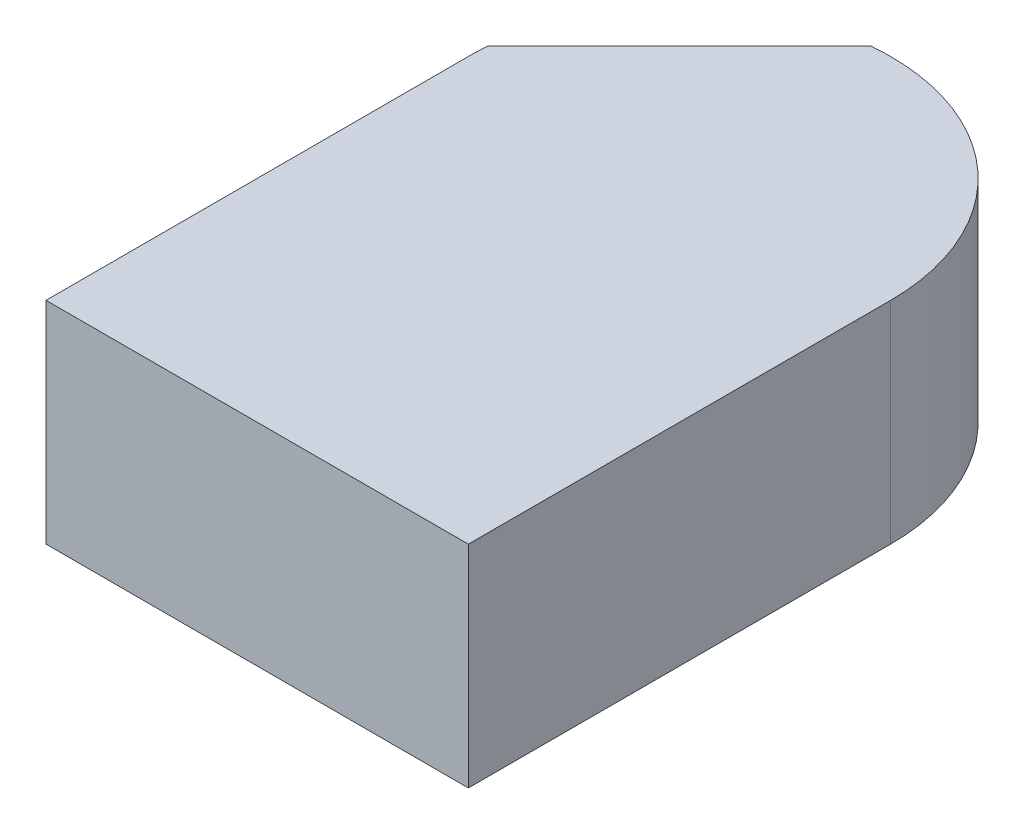
ISO-10303-21;
HEADER;
FILE_DESCRIPTION(('STEP AP214'),'2;1');
FILE_NAME('part.step','',(''),(''),'','','');
FILE_SCHEMA(('AUTOMOTIVE_DESIGN { 1 0 10303 214 1 1 1 1 }'));
ENDSEC;
DATA;
#1=APPLICATION_CONTEXT('core data for automotive mechanical design processes');
#2=APPLICATION_PROTOCOL_DEFINITION('international standard','automotive_design',2000,#1);
#3=PRODUCT_CONTEXT('',#1,'mechanical');
#4=PRODUCT('Part','Part','',(#3));
#5=PRODUCT_RELATED_PRODUCT_CATEGORY('part','',(#4));
#6=PRODUCT_DEFINITION_FORMATION('','',#4);
#7=PRODUCT_DEFINITION_CONTEXT('part definition',#1,'design');
#8=PRODUCT_DEFINITION('design','',#6,#7);
#9=PRODUCT_DEFINITION_SHAPE('','',#8);
#10=(LENGTH_UNIT() NAMED_UNIT(*) SI_UNIT(.MILLI.,.METRE.));
#11=(NAMED_UNIT(*) PLANE_ANGLE_UNIT() SI_UNIT($,.RADIAN.));
#12=(NAMED_UNIT(*) SI_UNIT($,.STERADIAN.) SOLID_ANGLE_UNIT());
#13=UNCERTAINTY_MEASURE_WITH_UNIT(LENGTH_MEASURE(1.E-05),#10,'distance_accuracy_value','');
#14=(GEOMETRIC_REPRESENTATION_CONTEXT(3) GLOBAL_UNCERTAINTY_ASSIGNED_CONTEXT((#13)) GLOBAL_UNIT_ASSIGNED_CONTEXT((#10,
#11,#12)) REPRESENTATION_CONTEXT('',''));
#15=CARTESIAN_POINT('',(0.,0.,0.));
#16=DIRECTION('',(0.,0.,1.));
#17=DIRECTION('',(1.,0.,0.));
#18=AXIS2_PLACEMENT_3D('',#15,#16,#17);
#19=CARTESIAN_POINT('',(0.,0.,0.));
#20=DIRECTION('',(0.,-1.,0.));
#21=DIRECTION('',(1.,0.,0.));
#22=AXIS2_PLACEMENT_3D('',#19,#20,#21);
#23=PLANE('',#22);
#24=CARTESIAN_POINT('',(-0.8,0.,2.05));
#25=DIRECTION('',(0.,-1.,0.));
#26=DIRECTION('',(-0.0898292575823554,0.,-0.995957180044505));
#27=AXIS2_PLACEMENT_3D('',#24,#25,#26);
#28=CIRCLE('',#27,0.1);
#29=CARTESIAN_POINT('',(-0.808982925758,0.,1.950404281996));
#30=VERTEX_POINT('',#29);
#31=CARTESIAN_POINT('',(-0.7,0.,2.05));
#32=VERTEX_POINT('',#31);
#33=EDGE_CURVE('E11',#30,#32,#28,.T.);
#34=ORIENTED_EDGE('',*,*,#33,.T.);
#35=DIRECTION('',(0.,0.,1.));
#36=VECTOR('',#35,1.);
#37=CARTESIAN_POINT('',(-0.7,0.,2.05));
#38=LINE('',#37,#36);
#39=CARTESIAN_POINT('',(-0.7,0.,2.25));
#40=VERTEX_POINT('',#39);
#41=EDGE_CURVE('E25',#32,#40,#38,.T.);
#42=ORIENTED_EDGE('',*,*,#41,.T.);
#43=DIRECTION('',(-1.,0.,0.));
#44=VECTOR('',#43,1.);
#45=CARTESIAN_POINT('',(-0.7,0.,2.25));
#46=LINE('',#45,#44);
#47=CARTESIAN_POINT('',(-0.9,0.,2.25));
#48=VERTEX_POINT('',#47);
#49=EDGE_CURVE('E143',#40,#48,#46,.T.);
#50=ORIENTED_EDGE('',*,*,#49,.T.);
#51=DIRECTION('',(0.,0.,-1.));
#52=VECTOR('',#51,1.);
#53=CARTESIAN_POINT('',(-0.9,0.,2.25));
#54=LINE('',#53,#52);
#55=CARTESIAN_POINT('',(-0.9,0.,2.05));
#56=VERTEX_POINT('',#55);
#57=EDGE_CURVE('E139',#48,#56,#54,.T.);
#58=ORIENTED_EDGE('',*,*,#57,.T.);
#59=CARTESIAN_POINT('',(-0.8,0.,2.05));
#60=DIRECTION('',(0.,-1.,0.));
#61=DIRECTION('',(-1.,0.,0.));
#62=AXIS2_PLACEMENT_3D('',#59,#60,#61);
#63=CIRCLE('',#62,0.1);
#64=CARTESIAN_POINT('',(-0.899595718005,0.,2.041017074242));
#65=VERTEX_POINT('',#64);
#66=EDGE_CURVE('E88',#56,#65,#63,.T.);
#67=ORIENTED_EDGE('',*,*,#66,.T.);
#68=DIRECTION('',(0.707106781186548,0.,-0.707106781186548));
#69=VECTOR('',#68,1.);
#70=CARTESIAN_POINT('',(-0.899595718005,0.,2.041017074242));
#71=LINE('',#70,#69);
#72=EDGE_CURVE('E132',#65,#30,#71,.T.);
#73=ORIENTED_EDGE('',*,*,#72,.T.);
#74=EDGE_LOOP('',(#34,#42,#50,#58,#67,#73));
#75=FACE_BOUND('',#74,.T.);
#76=ADVANCED_FACE('F17',(#75),#23,.T.);
#77=CARTESIAN_POINT('',(-0.899595718005,-0.02,2.041017074242));
#78=DIRECTION('',(0.707106781186548,0.,0.707106781186548));
#79=DIRECTION('',(0.707106781186548,0.,-0.707106781186548));
#80=AXIS2_PLACEMENT_3D('',#77,#78,#79);
#81=PLANE('',#80);
#82=DIRECTION('',(0.,-1.,0.));
#83=VECTOR('',#82,1.);
#84=CARTESIAN_POINT('',(-0.899595718005,0.1,2.041017074242));
#85=LINE('',#84,#83);
#86=CARTESIAN_POINT('',(-0.899595718004,0.1,2.041017074242));
#87=VERTEX_POINT('',#86);
#88=EDGE_CURVE('E128',#87,#65,#85,.T.);
#89=ORIENTED_EDGE('',*,*,#88,.F.);
#90=DIRECTION('',(0.707106781186548,0.,-0.707106781186548));
#91=VECTOR('',#90,1.);
#92=CARTESIAN_POINT('',(-0.899595718004,0.1,2.041017074242));
#93=LINE('',#92,#91);
#94=CARTESIAN_POINT('',(-0.808982925758,0.1,1.950404281996));
#95=VERTEX_POINT('',#94);
#96=EDGE_CURVE('E83',#87,#95,#93,.T.);
#97=ORIENTED_EDGE('',*,*,#96,.T.);
#98=DIRECTION('',(0.,-1.,0.));
#99=VECTOR('',#98,1.);
#100=CARTESIAN_POINT('',(-0.808982925758,0.1,1.950404281996));
#101=LINE('',#100,#99);
#102=EDGE_CURVE('E120',#95,#30,#101,.T.);
#103=ORIENTED_EDGE('',*,*,#102,.T.);
#104=ORIENTED_EDGE('',*,*,#72,.F.);
#105=EDGE_LOOP('',(#89,#97,#103,#104));
#106=FACE_BOUND('',#105,.T.);
#107=ADVANCED_FACE('F163',(#106),#81,.F.);
#108=CARTESIAN_POINT('',(-0.8,0.,2.05));
#109=DIRECTION('',(0.,-1.,0.));
#110=DIRECTION('',(-0.674600156543728,0.,0.738183330068607));
#111=AXIS2_PLACEMENT_3D('',#108,#109,#110);
#112=CYLINDRICAL_SURFACE('',#111,0.1);
#113=CARTESIAN_POINT('',(-0.8,0.1,2.05));
#114=DIRECTION('',(0.,-1.,0.));
#115=DIRECTION('',(-0.0898292575823554,0.,-0.995957180044505));
#116=AXIS2_PLACEMENT_3D('',#113,#114,#115);
#117=CIRCLE('',#116,0.1);
#118=CARTESIAN_POINT('',(-0.7,0.1,2.05));
#119=VERTEX_POINT('',#118);
#120=EDGE_CURVE('E116',#95,#119,#117,.T.);
#121=ORIENTED_EDGE('',*,*,#120,.T.);
#122=DIRECTION('',(0.,1.,0.));
#123=VECTOR('',#122,1.);
#124=CARTESIAN_POINT('',(-0.7,0.,2.05));
#125=LINE('',#124,#123);
#126=EDGE_CURVE('E111',#32,#119,#125,.T.);
#127=ORIENTED_EDGE('',*,*,#126,.F.);
#128=ORIENTED_EDGE('',*,*,#33,.F.);
#129=ORIENTED_EDGE('',*,*,#102,.F.);
#130=EDGE_LOOP('',(#121,#127,#128,#129));
#131=FACE_BOUND('',#130,.T.);
#132=ADVANCED_FACE('F160',(#131),#112,.T.);
#133=CARTESIAN_POINT('',(-0.7,0.,2.05));
#134=DIRECTION('',(-1.,0.,0.));
#135=DIRECTION('',(0.,0.,1.));
#136=AXIS2_PLACEMENT_3D('',#133,#134,#135);
#137=PLANE('',#136);
#138=ORIENTED_EDGE('',*,*,#126,.T.);
#139=DIRECTION('',(0.,0.,1.));
#140=VECTOR('',#139,1.);
#141=CARTESIAN_POINT('',(-0.7,0.1,2.05));
#142=LINE('',#141,#140);
#143=CARTESIAN_POINT('',(-0.7,0.1,2.25));
#144=VERTEX_POINT('',#143);
#145=EDGE_CURVE('E107',#119,#144,#142,.T.);
#146=ORIENTED_EDGE('',*,*,#145,.T.);
#147=DIRECTION('',(0.,1.,0.));
#148=VECTOR('',#147,1.);
#149=CARTESIAN_POINT('',(-0.7,0.,2.25));
#150=LINE('',#149,#148);
#151=EDGE_CURVE('E102',#40,#144,#150,.T.);
#152=ORIENTED_EDGE('',*,*,#151,.F.);
#153=ORIENTED_EDGE('',*,*,#41,.F.);
#154=EDGE_LOOP('',(#138,#146,#152,#153));
#155=FACE_BOUND('',#154,.T.);
#156=ADVANCED_FACE('F158',(#155),#137,.F.);
#157=CARTESIAN_POINT('',(-0.7,0.,2.25));
#158=DIRECTION('',(0.,0.,-1.));
#159=DIRECTION('',(-1.,0.,0.));
#160=AXIS2_PLACEMENT_3D('',#157,#158,#159);
#161=PLANE('',#160);
#162=ORIENTED_EDGE('',*,*,#151,.T.);
#163=DIRECTION('',(-1.,0.,0.));
#164=VECTOR('',#163,1.);
#165=CARTESIAN_POINT('',(-0.7,0.1,2.25));
#166=LINE('',#165,#164);
#167=CARTESIAN_POINT('',(-0.9,0.1,2.25));
#168=VERTEX_POINT('',#167);
#169=EDGE_CURVE('E98',#144,#168,#166,.T.);
#170=ORIENTED_EDGE('',*,*,#169,.T.);
#171=DIRECTION('',(0.,1.,0.));
#172=VECTOR('',#171,1.);
#173=CARTESIAN_POINT('',(-0.9,0.,2.25));
#174=LINE('',#173,#172);
#175=EDGE_CURVE('E74',#48,#168,#174,.T.);
#176=ORIENTED_EDGE('',*,*,#175,.F.);
#177=ORIENTED_EDGE('',*,*,#49,.F.);
#178=EDGE_LOOP('',(#162,#170,#176,#177));
#179=FACE_BOUND('',#178,.T.);
#180=ADVANCED_FACE('F153',(#179),#161,.F.);
#181=CARTESIAN_POINT('',(-0.9,0.,2.25));
#182=DIRECTION('',(1.,0.,0.));
#183=DIRECTION('',(0.,0.,-1.));
#184=AXIS2_PLACEMENT_3D('',#181,#182,#183);
#185=PLANE('',#184);
#186=ORIENTED_EDGE('',*,*,#175,.T.);
#187=DIRECTION('',(0.,0.,-1.));
#188=VECTOR('',#187,1.);
#189=CARTESIAN_POINT('',(-0.9,0.1,2.25));
#190=LINE('',#189,#188);
#191=CARTESIAN_POINT('',(-0.9,0.1,2.05));
#192=VERTEX_POINT('',#191);
#193=EDGE_CURVE('E66',#168,#192,#190,.T.);
#194=ORIENTED_EDGE('',*,*,#193,.T.);
#195=DIRECTION('',(0.,1.,0.));
#196=VECTOR('',#195,1.);
#197=CARTESIAN_POINT('',(-0.9,0.,2.05));
#198=LINE('',#197,#196);
#199=EDGE_CURVE('E71',#56,#192,#198,.T.);
#200=ORIENTED_EDGE('',*,*,#199,.F.);
#201=ORIENTED_EDGE('',*,*,#57,.F.);
#202=EDGE_LOOP('',(#186,#194,#200,#201));
#203=FACE_BOUND('',#202,.T.);
#204=ADVANCED_FACE('F68',(#203),#185,.F.);
#205=CARTESIAN_POINT('',(-0.8,0.,2.05));
#206=DIRECTION('',(0.,-1.,0.));
#207=DIRECTION('',(0.99898878373202,0.,0.0449600931673826));
#208=AXIS2_PLACEMENT_3D('',#205,#206,#207);
#209=CYLINDRICAL_SURFACE('',#208,0.1);
#210=ORIENTED_EDGE('',*,*,#66,.F.);
#211=ORIENTED_EDGE('',*,*,#199,.T.);
#212=CARTESIAN_POINT('',(-0.8,0.1,2.05));
#213=DIRECTION('',(0.,-1.,0.));
#214=DIRECTION('',(-1.,0.,0.));
#215=AXIS2_PLACEMENT_3D('',#212,#213,#214);
#216=CIRCLE('',#215,0.1);
#217=EDGE_CURVE('E80',#192,#87,#216,.T.);
#218=ORIENTED_EDGE('',*,*,#217,.T.);
#219=ORIENTED_EDGE('',*,*,#88,.T.);
#220=EDGE_LOOP('',(#210,#211,#218,#219));
#221=FACE_BOUND('',#220,.T.);
#222=ADVANCED_FACE('F87',(#221),#209,.T.);
#223=CARTESIAN_POINT('',(0.,0.1,0.));
#224=DIRECTION('',(0.,-1.,0.));
#225=DIRECTION('',(1.,0.,0.));
#226=AXIS2_PLACEMENT_3D('',#223,#224,#225);
#227=PLANE('',#226);
#228=ORIENTED_EDGE('',*,*,#217,.F.);
#229=ORIENTED_EDGE('',*,*,#193,.F.);
#230=ORIENTED_EDGE('',*,*,#169,.F.);
#231=ORIENTED_EDGE('',*,*,#145,.F.);
#232=ORIENTED_EDGE('',*,*,#120,.F.);
#233=ORIENTED_EDGE('',*,*,#96,.F.);
#234=EDGE_LOOP('',(#228,#229,#230,#231,#232,#233));
#235=FACE_BOUND('',#234,.T.);
#236=ADVANCED_FACE('F81',(#235),#227,.F.);
#237=CLOSED_SHELL('',(#76,#107,#132,#156,#180,#204,#222,#236));
#238=MANIFOLD_SOLID_BREP('B1',#237);
#239=ADVANCED_BREP_SHAPE_REPRESENTATION('',(#18,#238),#14);
#240=SHAPE_DEFINITION_REPRESENTATION(#9,#239);
ENDSEC;
END-ISO-10303-21;
